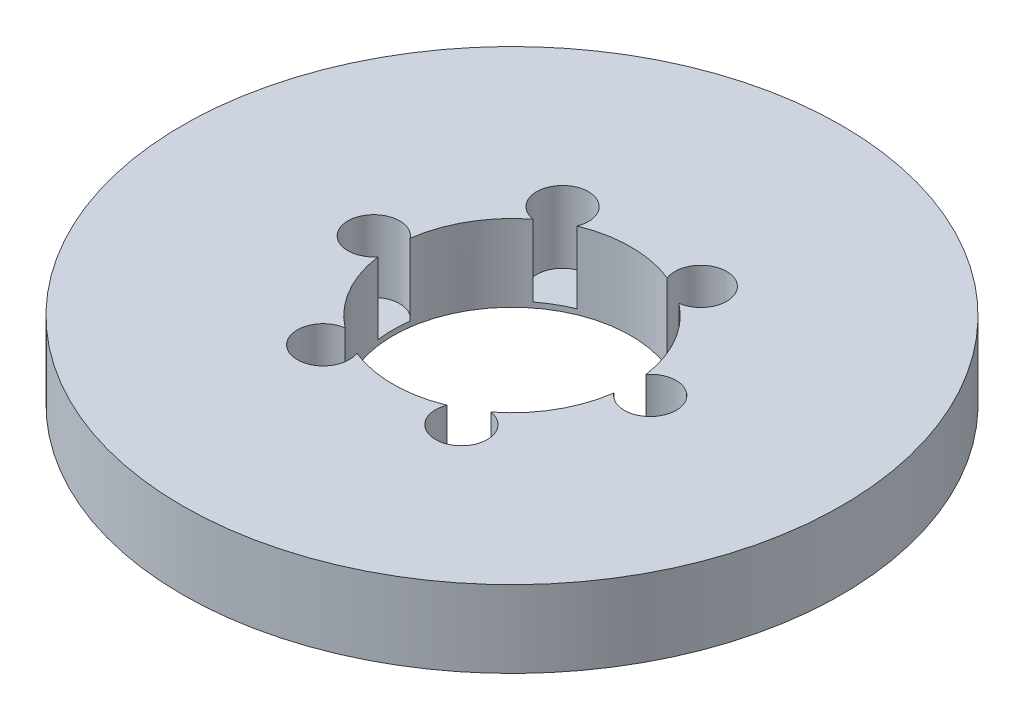
ISO-10303-21;
HEADER;
FILE_DESCRIPTION(('STEP AP214'),'2;1');
FILE_NAME('part.step','',(''),(''),'','','');
FILE_SCHEMA(('AUTOMOTIVE_DESIGN { 1 0 10303 214 1 1 1 1 }'));
ENDSEC;
DATA;
#1=APPLICATION_CONTEXT('core data for automotive mechanical design processes');
#2=APPLICATION_PROTOCOL_DEFINITION('international standard','automotive_design',2000,#1);
#3=PRODUCT_CONTEXT('',#1,'mechanical');
#4=PRODUCT('Part','Part','',(#3));
#5=PRODUCT_RELATED_PRODUCT_CATEGORY('part','',(#4));
#6=PRODUCT_DEFINITION_FORMATION('','',#4);
#7=PRODUCT_DEFINITION_CONTEXT('part definition',#1,'design');
#8=PRODUCT_DEFINITION('design','',#6,#7);
#9=PRODUCT_DEFINITION_SHAPE('','',#8);
#10=(LENGTH_UNIT() NAMED_UNIT(*) SI_UNIT(.MILLI.,.METRE.));
#11=(NAMED_UNIT(*) PLANE_ANGLE_UNIT() SI_UNIT($,.RADIAN.));
#12=(NAMED_UNIT(*) SI_UNIT($,.STERADIAN.) SOLID_ANGLE_UNIT());
#13=UNCERTAINTY_MEASURE_WITH_UNIT(LENGTH_MEASURE(1.E-05),#10,'distance_accuracy_value','');
#14=(GEOMETRIC_REPRESENTATION_CONTEXT(3) GLOBAL_UNCERTAINTY_ASSIGNED_CONTEXT((#13)) GLOBAL_UNIT_ASSIGNED_CONTEXT((#10,
#11,#12)) REPRESENTATION_CONTEXT('',''));
#15=CARTESIAN_POINT('',(0.,0.,0.));
#16=DIRECTION('',(0.,0.,1.));
#17=DIRECTION('',(1.,0.,0.));
#18=AXIS2_PLACEMENT_3D('',#15,#16,#17);
#19=CARTESIAN_POINT('',(0.,21.,0.));
#20=DIRECTION('',(0.,-1.,0.));
#21=DIRECTION('',(0.,0.,-1.));
#22=AXIS2_PLACEMENT_3D('',#19,#20,#21);
#23=CYLINDRICAL_SURFACE('',#22,90.);
#24=CARTESIAN_POINT('',(0.,21.,0.));
#25=DIRECTION('',(0.,1.,0.));
#26=DIRECTION('',(0.,0.,1.));
#27=AXIS2_PLACEMENT_3D('',#24,#25,#26);
#28=CIRCLE('',#27,90.);
#29=CARTESIAN_POINT('',(0.,21.,-90.));
#30=VERTEX_POINT('',#29);
#31=EDGE_CURVE('E171',#30,#30,#28,.T.);
#32=CARTESIAN_POINT('',(0.,0.,0.));
#33=DIRECTION('',(0.,1.,0.));
#34=DIRECTION('',(0.,0.,1.));
#35=AXIS2_PLACEMENT_3D('',#32,#33,#34);
#36=CIRCLE('',#35,90.);
#37=CARTESIAN_POINT('',(0.,0.,-90.));
#38=VERTEX_POINT('',#37);
#39=EDGE_CURVE('E157',#38,#38,#36,.T.);
#40=CARTESIAN_POINT('',(0.,21.,-90.));
#41=CARTESIAN_POINT('',(0.,20.78125,-90.));
#42=CARTESIAN_POINT('',(0.,20.5625,-90.));
#43=CARTESIAN_POINT('',(0.,20.125,-90.));
#44=CARTESIAN_POINT('',(0.,19.90625,-90.));
#45=CARTESIAN_POINT('',(0.,19.46875,-90.));
#46=CARTESIAN_POINT('',(0.,19.25,-90.));
#47=CARTESIAN_POINT('',(0.,18.8125,-90.));
#48=CARTESIAN_POINT('',(0.,18.59375,-90.));
#49=CARTESIAN_POINT('',(0.,18.15625,-90.));
#50=CARTESIAN_POINT('',(0.,17.9375,-90.));
#51=CARTESIAN_POINT('',(0.,17.5,-90.));
#52=CARTESIAN_POINT('',(0.,17.28125,-90.));
#53=CARTESIAN_POINT('',(0.,16.84375,-90.));
#54=CARTESIAN_POINT('',(0.,16.625,-90.));
#55=CARTESIAN_POINT('',(0.,16.1875,-90.));
#56=CARTESIAN_POINT('',(0.,15.96875,-90.));
#57=CARTESIAN_POINT('',(0.,15.53125,-90.));
#58=CARTESIAN_POINT('',(0.,15.3125,-90.));
#59=CARTESIAN_POINT('',(0.,14.875,-90.));
#60=CARTESIAN_POINT('',(0.,14.65625,-90.));
#61=CARTESIAN_POINT('',(0.,14.21875,-90.));
#62=CARTESIAN_POINT('',(0.,14.,-90.));
#63=CARTESIAN_POINT('',(0.,13.5625,-90.));
#64=CARTESIAN_POINT('',(0.,13.34375,-90.));
#65=CARTESIAN_POINT('',(0.,12.90625,-90.));
#66=CARTESIAN_POINT('',(0.,12.6875,-90.));
#67=CARTESIAN_POINT('',(0.,12.25,-90.));
#68=CARTESIAN_POINT('',(0.,12.03125,-90.));
#69=CARTESIAN_POINT('',(0.,11.59375,-90.));
#70=CARTESIAN_POINT('',(0.,11.375,-90.));
#71=CARTESIAN_POINT('',(0.,10.9375,-90.));
#72=CARTESIAN_POINT('',(0.,10.71875,-90.));
#73=CARTESIAN_POINT('',(0.,10.28125,-90.));
#74=CARTESIAN_POINT('',(0.,10.0625,-90.));
#75=CARTESIAN_POINT('',(0.,9.625,-90.));
#76=CARTESIAN_POINT('',(0.,9.40625,-90.));
#77=CARTESIAN_POINT('',(0.,8.96875,-90.));
#78=CARTESIAN_POINT('',(0.,8.75,-90.));
#79=CARTESIAN_POINT('',(0.,8.3125,-90.));
#80=CARTESIAN_POINT('',(0.,8.09375,-90.));
#81=CARTESIAN_POINT('',(0.,7.65625,-90.));
#82=CARTESIAN_POINT('',(0.,7.4375,-90.));
#83=CARTESIAN_POINT('',(0.,7.,-90.));
#84=CARTESIAN_POINT('',(0.,6.78125,-90.));
#85=CARTESIAN_POINT('',(0.,6.34375,-90.));
#86=CARTESIAN_POINT('',(0.,6.125,-90.));
#87=CARTESIAN_POINT('',(0.,5.6875,-90.));
#88=CARTESIAN_POINT('',(0.,5.46875,-90.));
#89=CARTESIAN_POINT('',(0.,5.03125,-90.));
#90=CARTESIAN_POINT('',(0.,4.8125,-90.));
#91=CARTESIAN_POINT('',(0.,4.375,-90.));
#92=CARTESIAN_POINT('',(0.,4.15625,-90.));
#93=CARTESIAN_POINT('',(0.,3.71875,-90.));
#94=CARTESIAN_POINT('',(0.,3.5,-90.));
#95=CARTESIAN_POINT('',(0.,3.0625,-90.));
#96=CARTESIAN_POINT('',(0.,2.84375,-90.));
#97=CARTESIAN_POINT('',(0.,2.40625,-90.));
#98=CARTESIAN_POINT('',(0.,2.1875,-90.));
#99=CARTESIAN_POINT('',(0.,1.75,-90.));
#100=CARTESIAN_POINT('',(0.,1.53125,-90.));
#101=CARTESIAN_POINT('',(0.,1.09375,-90.));
#102=CARTESIAN_POINT('',(0.,0.875000000000001,-90.));
#103=CARTESIAN_POINT('',(0.,0.4375,-90.));
#104=CARTESIAN_POINT('',(0.,0.21875,-90.));
#105=CARTESIAN_POINT('',(0.,0.,-90.));
#106=B_SPLINE_CURVE_WITH_KNOTS('',3,(#40,#41,#42,#43,#44,#45,#46,#47,#48,#49,#50,#51,#52,#53,
#54,#55,#56,#57,#58,#59,#60,#61,#62,#63,#64,#65,#66,#67,#68,#69,#70,#71,#72,#73,#74,#75,#76,#77,
#78,#79,#80,#81,#82,#83,#84,#85,#86,#87,#88,#89,#90,#91,#92,#93,#94,#95,#96,#97,#98,#99,#100,
#101,#102,#103,#104,#105),.UNSPECIFIED.,.F.,.F.,(4,2,2,2,2,2,2,2,2,2,2,2,2,2,2,2,2,2,2,2,2,2,2,
2,2,2,2,2,2,2,2,2,4),(0.,0.656250000000001,1.3125,1.96875,2.625,3.28125,3.9375,4.59375,5.25,
5.90625,6.5625,7.21875,7.875,8.53125,9.1875,9.84375,10.5,11.15625,11.8125,12.46875,13.125,
13.78125,14.4375,15.09375,15.75,16.40625,17.0625,17.71875,18.375,19.03125,19.6875,20.34375,21.),.UNSPECIFIED.);
#107=EDGE_CURVE('BSEAM39',#30,#38,#106,.T.);
#108=ORIENTED_EDGE('',*,*,#31,.F.);
#109=ORIENTED_EDGE('',*,*,#39,.T.);
#110=ORIENTED_EDGE('',*,*,#107,.T.);
#111=ORIENTED_EDGE('',*,*,#107,.F.);
#112=EDGE_LOOP('',(#108,#110,#109,#111));
#113=FACE_BOUND('',#112,.T.);
#114=ADVANCED_FACE('F39',(#113),#23,.T.);
#115=CARTESIAN_POINT('',(0.,21.,0.));
#116=DIRECTION('',(0.,1.,0.));
#117=DIRECTION('',(0.,0.,1.));
#118=AXIS2_PLACEMENT_3D('',#115,#116,#117);
#119=PLANE('',#118);
#120=CARTESIAN_POINT('',(-18.8720697504449,21.,-32.6873836517533));
#121=DIRECTION('',(0.,1.,0.));
#122=DIRECTION('',(-0.866025403784433,0.,0.50000000000001));
#123=AXIS2_PLACEMENT_3D('',#120,#121,#122);
#124=CIRCLE('',#123,7.07533235487481);
#125=CARTESIAN_POINT('',(-12.2924630018324,21.,-30.0856336703846));
#126=VERTEX_POINT('',#125);
#127=CARTESIAN_POINT('',(-19.9086915465899,21.,-25.6884020698591));
#128=VERTEX_POINT('',#127);
#129=EDGE_CURVE('E214',#126,#128,#124,.T.);
#130=ORIENTED_EDGE('',*,*,#129,.F.);
#131=CARTESIAN_POINT('',(0.,21.,0.));
#132=DIRECTION('',(0.,1.,0.));
#133=DIRECTION('',(0.,0.,1.));
#134=AXIS2_PLACEMENT_3D('',#131,#132,#133);
#135=CIRCLE('',#134,32.5);
#136=CARTESIAN_POINT('',(12.2924630018318,21.,-30.0856336703849));
#137=VERTEX_POINT('',#136);
#138=EDGE_CURVE('E272',#137,#126,#135,.T.);
#139=ORIENTED_EDGE('',*,*,#138,.F.);
#140=CARTESIAN_POINT('',(18.8720697504442,21.,-32.6873836517537));
#141=DIRECTION('',(0.,1.,0.));
#142=DIRECTION('',(-0.866025403784443,0.,-0.499999999999992));
#143=AXIS2_PLACEMENT_3D('',#140,#141,#142);
#144=CIRCLE('',#143,7.07533235487481);
#145=CARTESIAN_POINT('',(19.9086915465894,21.,-25.6884020698595));
#146=VERTEX_POINT('',#145);
#147=EDGE_CURVE('E285',#146,#137,#144,.T.);
#148=ORIENTED_EDGE('',*,*,#147,.F.);
#149=CARTESIAN_POINT('',(32.2011545484217,21.,-4.39723160052547));
#150=VERTEX_POINT('',#149);
#151=EDGE_CURVE('E165',#150,#146,#135,.T.);
#152=ORIENTED_EDGE('',*,*,#151,.F.);
#153=CARTESIAN_POINT('',(37.744139500889,21.,0.));
#154=DIRECTION('',(0.,1.,0.));
#155=DIRECTION('',(0.,0.,-1.));
#156=AXIS2_PLACEMENT_3D('',#153,#154,#155);
#157=CIRCLE('',#156,7.07533235487481);
#158=CARTESIAN_POINT('',(32.2011545484217,21.,4.39723160052547));
#159=VERTEX_POINT('',#158);
#160=EDGE_CURVE('E281',#159,#150,#157,.T.);
#161=ORIENTED_EDGE('',*,*,#160,.F.);
#162=CARTESIAN_POINT('',(19.9086915465897,21.,25.6884020698592));
#163=VERTEX_POINT('',#162);
#164=EDGE_CURVE('E160',#163,#159,#135,.T.);
#165=ORIENTED_EDGE('',*,*,#164,.F.);
#166=CARTESIAN_POINT('',(18.8720697504446,21.,32.6873836517535));
#167=DIRECTION('',(0.,1.,0.));
#168=DIRECTION('',(0.866025403784436,0.,-0.500000000000004));
#169=AXIS2_PLACEMENT_3D('',#166,#167,#168);
#170=CIRCLE('',#169,7.07533235487481);
#171=CARTESIAN_POINT('',(12.2924630018322,21.,30.0856336703847));
#172=VERTEX_POINT('',#171);
#173=EDGE_CURVE('E154',#172,#163,#170,.T.);
#174=ORIENTED_EDGE('',*,*,#173,.F.);
#175=CARTESIAN_POINT('',(-12.292463001832,21.,30.0856336703848));
#176=VERTEX_POINT('',#175);
#177=EDGE_CURVE('E150',#176,#172,#135,.T.);
#178=ORIENTED_EDGE('',*,*,#177,.F.);
#179=CARTESIAN_POINT('',(-18.8720697504444,21.,32.6873836517536));
#180=DIRECTION('',(0.,1.,0.));
#181=DIRECTION('',(0.86602540378444,0.,0.499999999999998));
#182=AXIS2_PLACEMENT_3D('',#179,#180,#181);
#183=CIRCLE('',#182,7.07533235487481);
#184=CARTESIAN_POINT('',(-19.9086915465896,21.,25.6884020698593));
#185=VERTEX_POINT('',#184);
#186=EDGE_CURVE('E127',#185,#176,#183,.T.);
#187=ORIENTED_EDGE('',*,*,#186,.F.);
#188=CARTESIAN_POINT('',(-32.2011545484217,21.,4.39723160052547));
#189=VERTEX_POINT('',#188);
#190=EDGE_CURVE('E156',#189,#185,#135,.T.);
#191=ORIENTED_EDGE('',*,*,#190,.F.);
#192=CARTESIAN_POINT('',(-37.744139500889,21.,0.));
#193=DIRECTION('',(0.,1.,0.));
#194=DIRECTION('',(0.,0.,1.));
#195=AXIS2_PLACEMENT_3D('',#192,#193,#194);
#196=CIRCLE('',#195,7.07533235487481);
#197=CARTESIAN_POINT('',(-32.2011545484217,21.,-4.39723160052547));
#198=VERTEX_POINT('',#197);
#199=EDGE_CURVE('E164',#198,#189,#196,.T.);
#200=ORIENTED_EDGE('',*,*,#199,.F.);
#201=EDGE_CURVE('E159',#128,#198,#135,.T.);
#202=ORIENTED_EDGE('',*,*,#201,.F.);
#203=EDGE_LOOP('',(#130,#139,#148,#152,#161,#165,#174,#178,#187,#191,#200,#202));
#204=FACE_BOUND('',#203,.T.);
#205=ORIENTED_EDGE('',*,*,#31,.T.);
#206=EDGE_LOOP('',(#205));
#207=FACE_BOUND('',#206,.T.);
#208=ADVANCED_FACE('F155',(#204,#207),#119,.T.);
#209=CARTESIAN_POINT('',(0.,0.,0.));
#210=DIRECTION('',(0.,1.,0.));
#211=DIRECTION('',(0.,0.,1.));
#212=AXIS2_PLACEMENT_3D('',#209,#210,#211);
#213=PLANE('',#212);
#214=CARTESIAN_POINT('',(0.,0.,0.));
#215=DIRECTION('',(0.,1.,0.));
#216=DIRECTION('',(0.,0.,1.));
#217=AXIS2_PLACEMENT_3D('',#214,#215,#216);
#218=CIRCLE('',#217,32.5);
#219=CARTESIAN_POINT('',(0.,0.,32.5));
#220=VERTEX_POINT('',#219);
#221=EDGE_CURVE('E170',#220,#220,#218,.T.);
#222=ORIENTED_EDGE('',*,*,#221,.T.);
#223=EDGE_LOOP('',(#222));
#224=FACE_BOUND('',#223,.T.);
#225=ORIENTED_EDGE('',*,*,#39,.F.);
#226=EDGE_LOOP('',(#225));
#227=FACE_BOUND('',#226,.T.);
#228=ADVANCED_FACE('F232',(#224,#227),#213,.F.);
#229=CARTESIAN_POINT('',(0.,21.,0.));
#230=DIRECTION('',(0.,-1.,0.));
#231=DIRECTION('',(0.,0.,-1.));
#232=AXIS2_PLACEMENT_3D('',#229,#230,#231);
#233=CYLINDRICAL_SURFACE('',#232,32.5);
#234=DIRECTION('',(0.,1.,0.));
#235=VECTOR('',#234,1.);
#236=CARTESIAN_POINT('',(-12.2924630018324,11.2050750130639,-30.0856336703846));
#237=LINE('',#236,#235);
#238=CARTESIAN_POINT('',(-12.2924630018324,1.41015002612772,-30.0856336703846));
#239=VERTEX_POINT('',#238);
#240=EDGE_CURVE('E11',#239,#126,#237,.T.);
#241=ORIENTED_EDGE('',*,*,#240,.F.);
#242=CARTESIAN_POINT('',(0.,1.41015002612772,0.));
#243=DIRECTION('',(0.,1.,0.));
#244=DIRECTION('',(0.,0.,1.));
#245=AXIS2_PLACEMENT_3D('',#242,#243,#244);
#246=CIRCLE('',#245,32.5);
#247=CARTESIAN_POINT('',(-19.9086915465899,1.41015002612772,-25.6884020698591));
#248=VERTEX_POINT('',#247);
#249=EDGE_CURVE('E209',#239,#248,#246,.T.);
#250=ORIENTED_EDGE('',*,*,#249,.T.);
#251=DIRECTION('',(0.,1.,0.));
#252=VECTOR('',#251,1.);
#253=CARTESIAN_POINT('',(-19.9086915465899,11.2050750130639,-25.6884020698591));
#254=LINE('',#253,#252);
#255=EDGE_CURVE('E46',#128,#248,#254,.F.);
#256=ORIENTED_EDGE('',*,*,#255,.F.);
#257=ORIENTED_EDGE('',*,*,#201,.T.);
#258=DIRECTION('',(0.,1.,0.));
#259=VECTOR('',#258,1.);
#260=CARTESIAN_POINT('',(-32.2011545484217,11.2050750130639,-4.39723160052547));
#261=LINE('',#260,#259);
#262=CARTESIAN_POINT('',(-32.2011545484217,1.41015002612772,-4.39723160052547));
#263=VERTEX_POINT('',#262);
#264=EDGE_CURVE('E185',#263,#198,#261,.T.);
#265=ORIENTED_EDGE('',*,*,#264,.F.);
#266=CARTESIAN_POINT('',(0.,1.41015002612772,0.));
#267=DIRECTION('',(0.,1.,0.));
#268=DIRECTION('',(0.,0.,1.));
#269=AXIS2_PLACEMENT_3D('',#266,#267,#268);
#270=CIRCLE('',#269,32.5);
#271=CARTESIAN_POINT('',(-32.2011545484217,1.41015002612772,4.39723160052547));
#272=VERTEX_POINT('',#271);
#273=EDGE_CURVE('E173',#263,#272,#270,.T.);
#274=ORIENTED_EDGE('',*,*,#273,.T.);
#275=DIRECTION('',(0.,1.,0.));
#276=VECTOR('',#275,1.);
#277=CARTESIAN_POINT('',(-32.2011545484217,11.2050750130639,4.39723160052547));
#278=LINE('',#277,#276);
#279=EDGE_CURVE('E178',#189,#272,#278,.F.);
#280=ORIENTED_EDGE('',*,*,#279,.F.);
#281=ORIENTED_EDGE('',*,*,#190,.T.);
#282=DIRECTION('',(0.,1.,0.));
#283=VECTOR('',#282,1.);
#284=CARTESIAN_POINT('',(-19.9086915465896,11.2050750130639,25.6884020698593));
#285=LINE('',#284,#283);
#286=CARTESIAN_POINT('',(-19.9086915465896,1.41015002612772,25.6884020698593));
#287=VERTEX_POINT('',#286);
#288=EDGE_CURVE('E132',#287,#185,#285,.T.);
#289=ORIENTED_EDGE('',*,*,#288,.F.);
#290=CARTESIAN_POINT('',(0.,1.41015002612772,0.));
#291=DIRECTION('',(0.,1.,0.));
#292=DIRECTION('',(0.,0.,1.));
#293=AXIS2_PLACEMENT_3D('',#290,#291,#292);
#294=CIRCLE('',#293,32.5);
#295=CARTESIAN_POINT('',(-12.292463001832,1.41015002612772,30.0856336703848));
#296=VERTEX_POINT('',#295);
#297=EDGE_CURVE('E146',#287,#296,#294,.T.);
#298=ORIENTED_EDGE('',*,*,#297,.T.);
#299=DIRECTION('',(0.,1.,0.));
#300=VECTOR('',#299,1.);
#301=CARTESIAN_POINT('',(-12.292463001832,11.2050750130639,30.0856336703848));
#302=LINE('',#301,#300);
#303=EDGE_CURVE('E128',#176,#296,#302,.F.);
#304=ORIENTED_EDGE('',*,*,#303,.F.);
#305=ORIENTED_EDGE('',*,*,#177,.T.);
#306=DIRECTION('',(0.,1.,0.));
#307=VECTOR('',#306,1.);
#308=CARTESIAN_POINT('',(12.2924630018322,11.2050750130639,30.0856336703847));
#309=LINE('',#308,#307);
#310=CARTESIAN_POINT('',(12.2924630018322,1.41015002612772,30.0856336703847));
#311=VERTEX_POINT('',#310);
#312=EDGE_CURVE('E192',#311,#172,#309,.T.);
#313=ORIENTED_EDGE('',*,*,#312,.F.);
#314=CARTESIAN_POINT('',(0.,1.41015002612772,0.));
#315=DIRECTION('',(0.,1.,0.));
#316=DIRECTION('',(0.,0.,1.));
#317=AXIS2_PLACEMENT_3D('',#314,#315,#316);
#318=CIRCLE('',#317,32.5);
#319=CARTESIAN_POINT('',(19.9086915465897,1.41015002612772,25.6884020698592));
#320=VERTEX_POINT('',#319);
#321=EDGE_CURVE('E190',#311,#320,#318,.T.);
#322=ORIENTED_EDGE('',*,*,#321,.T.);
#323=DIRECTION('',(0.,1.,0.));
#324=VECTOR('',#323,1.);
#325=CARTESIAN_POINT('',(19.9086915465897,11.2050750130639,25.6884020698592));
#326=LINE('',#325,#324);
#327=EDGE_CURVE('E189',#163,#320,#326,.F.);
#328=ORIENTED_EDGE('',*,*,#327,.F.);
#329=ORIENTED_EDGE('',*,*,#164,.T.);
#330=DIRECTION('',(0.,1.,0.));
#331=VECTOR('',#330,1.);
#332=CARTESIAN_POINT('',(32.2011545484217,11.2050750130639,4.39723160052547));
#333=LINE('',#332,#331);
#334=CARTESIAN_POINT('',(32.2011545484217,1.41015002612772,4.39723160052547));
#335=VERTEX_POINT('',#334);
#336=EDGE_CURVE('E203',#335,#159,#333,.T.);
#337=ORIENTED_EDGE('',*,*,#336,.F.);
#338=CARTESIAN_POINT('',(0.,1.41015002612772,0.));
#339=DIRECTION('',(0.,1.,0.));
#340=DIRECTION('',(0.,0.,1.));
#341=AXIS2_PLACEMENT_3D('',#338,#339,#340);
#342=CIRCLE('',#341,32.5);
#343=CARTESIAN_POINT('',(32.2011545484217,1.41015002612772,-4.39723160052547));
#344=VERTEX_POINT('',#343);
#345=EDGE_CURVE('E194',#335,#344,#342,.T.);
#346=ORIENTED_EDGE('',*,*,#345,.T.);
#347=DIRECTION('',(0.,1.,0.));
#348=VECTOR('',#347,1.);
#349=CARTESIAN_POINT('',(32.2011545484217,11.2050750130639,-4.39723160052547));
#350=LINE('',#349,#348);
#351=EDGE_CURVE('E196',#150,#344,#350,.F.);
#352=ORIENTED_EDGE('',*,*,#351,.F.);
#353=ORIENTED_EDGE('',*,*,#151,.T.);
#354=DIRECTION('',(0.,1.,0.));
#355=VECTOR('',#354,1.);
#356=CARTESIAN_POINT('',(19.9086915465894,11.2050750130639,-25.6884020698595));
#357=LINE('',#356,#355);
#358=CARTESIAN_POINT('',(19.9086915465894,1.41015002612772,-25.6884020698595));
#359=VERTEX_POINT('',#358);
#360=EDGE_CURVE('E208',#359,#146,#357,.T.);
#361=ORIENTED_EDGE('',*,*,#360,.F.);
#362=CARTESIAN_POINT('',(0.,1.41015002612772,0.));
#363=DIRECTION('',(0.,1.,0.));
#364=DIRECTION('',(0.,0.,1.));
#365=AXIS2_PLACEMENT_3D('',#362,#363,#364);
#366=CIRCLE('',#365,32.5);
#367=CARTESIAN_POINT('',(12.2924630018318,1.41015002612772,-30.0856336703849));
#368=VERTEX_POINT('',#367);
#369=EDGE_CURVE('E201',#359,#368,#366,.T.);
#370=ORIENTED_EDGE('',*,*,#369,.T.);
#371=DIRECTION('',(0.,1.,0.));
#372=VECTOR('',#371,1.);
#373=CARTESIAN_POINT('',(12.2924630018318,11.2050750130639,-30.0856336703849));
#374=LINE('',#373,#372);
#375=EDGE_CURVE('E206',#137,#368,#374,.F.);
#376=ORIENTED_EDGE('',*,*,#375,.F.);
#377=ORIENTED_EDGE('',*,*,#138,.T.);
#378=EDGE_LOOP('',(#241,#250,#256,#257,#265,#274,#280,#281,#289,#298,#304,#305,#313,#322,#328,
#329,#337,#346,#352,#353,#361,#370,#376,#377));
#379=FACE_BOUND('',#378,.T.);
#380=ORIENTED_EDGE('',*,*,#221,.F.);
#381=EDGE_LOOP('',(#380));
#382=FACE_BOUND('',#381,.T.);
#383=ADVANCED_FACE('F145',(#379,#382),#233,.F.);
#384=CARTESIAN_POINT('',(-37.744139500889,1.41015002612772,0.));
#385=DIRECTION('',(0.,1.,0.));
#386=DIRECTION('',(0.,0.,1.));
#387=AXIS2_PLACEMENT_3D('',#384,#385,#386);
#388=CYLINDRICAL_SURFACE('',#387,7.07533235487481);
#389=ORIENTED_EDGE('',*,*,#264,.T.);
#390=ORIENTED_EDGE('',*,*,#199,.T.);
#391=ORIENTED_EDGE('',*,*,#279,.T.);
#392=CARTESIAN_POINT('',(-37.744139500889,1.41015002612772,0.));
#393=DIRECTION('',(0.,1.,0.));
#394=DIRECTION('',(0.,0.,1.));
#395=AXIS2_PLACEMENT_3D('',#392,#393,#394);
#396=CIRCLE('',#395,7.07533235487481);
#397=EDGE_CURVE('E168',#263,#272,#396,.T.);
#398=ORIENTED_EDGE('',*,*,#397,.F.);
#399=EDGE_LOOP('',(#389,#390,#391,#398));
#400=FACE_BOUND('',#399,.T.);
#401=ADVANCED_FACE('F243',(#400),#388,.F.);
#402=CARTESIAN_POINT('',(-37.744139500889,1.41015002612772,0.));
#403=DIRECTION('',(0.,1.,0.));
#404=DIRECTION('',(0.,0.,1.));
#405=AXIS2_PLACEMENT_3D('',#402,#403,#404);
#406=PLANE('',#405);
#407=ORIENTED_EDGE('',*,*,#397,.T.);
#408=ORIENTED_EDGE('',*,*,#273,.F.);
#409=EDGE_LOOP('',(#407,#408));
#410=FACE_BOUND('',#409,.T.);
#411=ADVANCED_FACE('F247',(#410),#406,.T.);
#412=CARTESIAN_POINT('',(-18.8720697504444,1.41015002612772,32.6873836517536));
#413=DIRECTION('',(0.,1.,0.));
#414=DIRECTION('',(0.,0.,1.));
#415=AXIS2_PLACEMENT_3D('',#412,#413,#414);
#416=CYLINDRICAL_SURFACE('',#415,7.07533235487481);
#417=ORIENTED_EDGE('',*,*,#288,.T.);
#418=ORIENTED_EDGE('',*,*,#186,.T.);
#419=ORIENTED_EDGE('',*,*,#303,.T.);
#420=CARTESIAN_POINT('',(-18.8720697504444,1.41015002612772,32.6873836517536));
#421=DIRECTION('',(0.,1.,0.));
#422=DIRECTION('',(0.86602540378444,0.,0.499999999999998));
#423=AXIS2_PLACEMENT_3D('',#420,#421,#422);
#424=CIRCLE('',#423,7.07533235487481);
#425=EDGE_CURVE('E137',#287,#296,#424,.T.);
#426=ORIENTED_EDGE('',*,*,#425,.F.);
#427=EDGE_LOOP('',(#417,#418,#419,#426));
#428=FACE_BOUND('',#427,.T.);
#429=ADVANCED_FACE('F126',(#428),#416,.F.);
#430=CARTESIAN_POINT('',(-18.8720697504444,1.41015002612772,32.6873836517536));
#431=DIRECTION('',(0.,1.,0.));
#432=DIRECTION('',(0.86602540378444,0.,0.499999999999998));
#433=AXIS2_PLACEMENT_3D('',#430,#431,#432);
#434=PLANE('',#433);
#435=ORIENTED_EDGE('',*,*,#425,.T.);
#436=ORIENTED_EDGE('',*,*,#297,.F.);
#437=EDGE_LOOP('',(#435,#436));
#438=FACE_BOUND('',#437,.T.);
#439=ADVANCED_FACE('F254',(#438),#434,.T.);
#440=CARTESIAN_POINT('',(18.8720697504446,1.41015002612772,32.6873836517535));
#441=DIRECTION('',(0.,1.,0.));
#442=DIRECTION('',(0.,0.,1.));
#443=AXIS2_PLACEMENT_3D('',#440,#441,#442);
#444=CYLINDRICAL_SURFACE('',#443,7.07533235487481);
#445=ORIENTED_EDGE('',*,*,#312,.T.);
#446=ORIENTED_EDGE('',*,*,#173,.T.);
#447=ORIENTED_EDGE('',*,*,#327,.T.);
#448=CARTESIAN_POINT('',(18.8720697504446,1.41015002612772,32.6873836517535));
#449=DIRECTION('',(0.,1.,0.));
#450=DIRECTION('',(0.866025403784436,0.,-0.500000000000004));
#451=AXIS2_PLACEMENT_3D('',#448,#449,#450);
#452=CIRCLE('',#451,7.07533235487481);
#453=EDGE_CURVE('E138',#311,#320,#452,.T.);
#454=ORIENTED_EDGE('',*,*,#453,.F.);
#455=EDGE_LOOP('',(#445,#446,#447,#454));
#456=FACE_BOUND('',#455,.T.);
#457=ADVANCED_FACE('F260',(#456),#444,.F.);
#458=CARTESIAN_POINT('',(18.8720697504446,1.41015002612772,32.6873836517535));
#459=DIRECTION('',(0.,1.,0.));
#460=DIRECTION('',(0.866025403784436,0.,-0.500000000000004));
#461=AXIS2_PLACEMENT_3D('',#458,#459,#460);
#462=PLANE('',#461);
#463=ORIENTED_EDGE('',*,*,#453,.T.);
#464=ORIENTED_EDGE('',*,*,#321,.F.);
#465=EDGE_LOOP('',(#463,#464));
#466=FACE_BOUND('',#465,.T.);
#467=ADVANCED_FACE('F265',(#466),#462,.T.);
#468=CARTESIAN_POINT('',(37.744139500889,1.41015002612772,0.));
#469=DIRECTION('',(0.,1.,0.));
#470=DIRECTION('',(0.,0.,1.));
#471=AXIS2_PLACEMENT_3D('',#468,#469,#470);
#472=CYLINDRICAL_SURFACE('',#471,7.07533235487481);
#473=ORIENTED_EDGE('',*,*,#336,.T.);
#474=ORIENTED_EDGE('',*,*,#160,.T.);
#475=ORIENTED_EDGE('',*,*,#351,.T.);
#476=CARTESIAN_POINT('',(37.744139500889,1.41015002612772,0.));
#477=DIRECTION('',(0.,1.,0.));
#478=DIRECTION('',(0.,0.,-1.));
#479=AXIS2_PLACEMENT_3D('',#476,#477,#478);
#480=CIRCLE('',#479,7.07533235487481);
#481=EDGE_CURVE('E287',#335,#344,#480,.T.);
#482=ORIENTED_EDGE('',*,*,#481,.F.);
#483=EDGE_LOOP('',(#473,#474,#475,#482));
#484=FACE_BOUND('',#483,.T.);
#485=ADVANCED_FACE('F300',(#484),#472,.F.);
#486=CARTESIAN_POINT('',(37.744139500889,1.41015002612772,0.));
#487=DIRECTION('',(0.,1.,0.));
#488=DIRECTION('',(0.,0.,-1.));
#489=AXIS2_PLACEMENT_3D('',#486,#487,#488);
#490=PLANE('',#489);
#491=ORIENTED_EDGE('',*,*,#481,.T.);
#492=ORIENTED_EDGE('',*,*,#345,.F.);
#493=EDGE_LOOP('',(#491,#492));
#494=FACE_BOUND('',#493,.T.);
#495=ADVANCED_FACE('F298',(#494),#490,.T.);
#496=CARTESIAN_POINT('',(18.8720697504442,1.41015002612772,-32.6873836517537));
#497=DIRECTION('',(0.,1.,0.));
#498=DIRECTION('',(0.,0.,1.));
#499=AXIS2_PLACEMENT_3D('',#496,#497,#498);
#500=CYLINDRICAL_SURFACE('',#499,7.07533235487481);
#501=ORIENTED_EDGE('',*,*,#360,.T.);
#502=ORIENTED_EDGE('',*,*,#147,.T.);
#503=ORIENTED_EDGE('',*,*,#375,.T.);
#504=CARTESIAN_POINT('',(18.8720697504442,1.41015002612772,-32.6873836517537));
#505=DIRECTION('',(0.,1.,0.));
#506=DIRECTION('',(-0.866025403784443,0.,-0.499999999999992));
#507=AXIS2_PLACEMENT_3D('',#504,#505,#506);
#508=CIRCLE('',#507,7.07533235487481);
#509=EDGE_CURVE('E56',#359,#368,#508,.T.);
#510=ORIENTED_EDGE('',*,*,#509,.F.);
#511=EDGE_LOOP('',(#501,#502,#503,#510));
#512=FACE_BOUND('',#511,.T.);
#513=ADVANCED_FACE('F301',(#512),#500,.F.);
#514=CARTESIAN_POINT('',(18.8720697504442,1.41015002612772,-32.6873836517537));
#515=DIRECTION('',(0.,1.,0.));
#516=DIRECTION('',(-0.866025403784443,0.,-0.499999999999992));
#517=AXIS2_PLACEMENT_3D('',#514,#515,#516);
#518=PLANE('',#517);
#519=ORIENTED_EDGE('',*,*,#509,.T.);
#520=ORIENTED_EDGE('',*,*,#369,.F.);
#521=EDGE_LOOP('',(#519,#520));
#522=FACE_BOUND('',#521,.T.);
#523=ADVANCED_FACE('F221',(#522),#518,.T.);
#524=CARTESIAN_POINT('',(-18.8720697504449,1.41015002612772,-32.6873836517533));
#525=DIRECTION('',(0.,1.,0.));
#526=DIRECTION('',(0.,0.,1.));
#527=AXIS2_PLACEMENT_3D('',#524,#525,#526);
#528=CYLINDRICAL_SURFACE('',#527,7.07533235487481);
#529=ORIENTED_EDGE('',*,*,#240,.T.);
#530=ORIENTED_EDGE('',*,*,#129,.T.);
#531=ORIENTED_EDGE('',*,*,#255,.T.);
#532=CARTESIAN_POINT('',(-18.8720697504449,1.41015002612772,-32.6873836517533));
#533=DIRECTION('',(0.,1.,0.));
#534=DIRECTION('',(-0.866025403784433,0.,0.50000000000001));
#535=AXIS2_PLACEMENT_3D('',#532,#533,#534);
#536=CIRCLE('',#535,7.07533235487481);
#537=EDGE_CURVE('E55',#239,#248,#536,.T.);
#538=ORIENTED_EDGE('',*,*,#537,.F.);
#539=EDGE_LOOP('',(#529,#530,#531,#538));
#540=FACE_BOUND('',#539,.T.);
#541=ADVANCED_FACE('F212',(#540),#528,.F.);
#542=CARTESIAN_POINT('',(-18.8720697504449,1.41015002612772,-32.6873836517533));
#543=DIRECTION('',(0.,1.,0.));
#544=DIRECTION('',(-0.866025403784433,0.,0.50000000000001));
#545=AXIS2_PLACEMENT_3D('',#542,#543,#544);
#546=PLANE('',#545);
#547=ORIENTED_EDGE('',*,*,#537,.T.);
#548=ORIENTED_EDGE('',*,*,#249,.F.);
#549=EDGE_LOOP('',(#547,#548));
#550=FACE_BOUND('',#549,.T.);
#551=ADVANCED_FACE('F217',(#550),#546,.T.);
#552=CLOSED_SHELL('',(#114,#208,#228,#383,#401,#411,#429,#439,#457,#467,#485,#495,#513,#523,
#541,#551));
#553=MANIFOLD_SOLID_BREP('B2',#552);
#554=ADVANCED_BREP_SHAPE_REPRESENTATION('',(#18,#553),#14);
#555=SHAPE_DEFINITION_REPRESENTATION(#9,#554);
ENDSEC;
END-ISO-10303-21;
